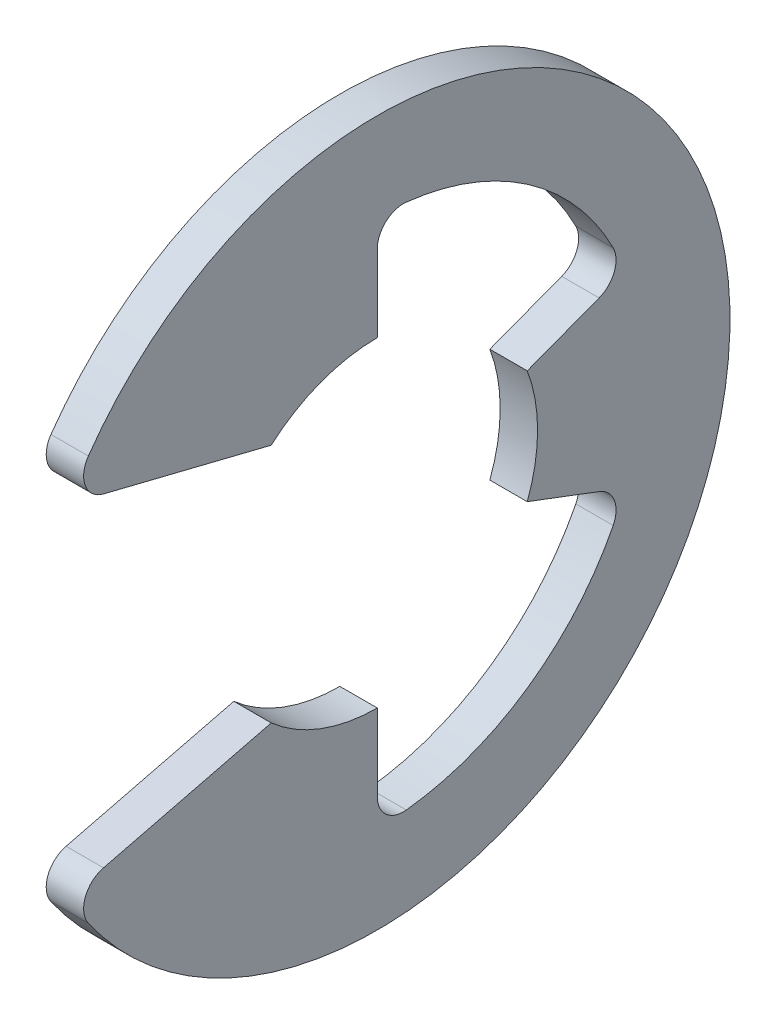
ISO-10303-21;
HEADER;
FILE_DESCRIPTION(('STEP AP214'),'2;1');
FILE_NAME('part.step','',(''),(''),'','','');
FILE_SCHEMA(('AUTOMOTIVE_DESIGN { 1 0 10303 214 1 1 1 1 }'));
ENDSEC;
DATA;
#1=APPLICATION_CONTEXT('core data for automotive mechanical design processes');
#2=APPLICATION_PROTOCOL_DEFINITION('international standard','automotive_design',2000,#1);
#3=PRODUCT_CONTEXT('',#1,'mechanical');
#4=PRODUCT('Part','Part','',(#3));
#5=PRODUCT_RELATED_PRODUCT_CATEGORY('part','',(#4));
#6=PRODUCT_DEFINITION_FORMATION('','',#4);
#7=PRODUCT_DEFINITION_CONTEXT('part definition',#1,'design');
#8=PRODUCT_DEFINITION('design','',#6,#7);
#9=PRODUCT_DEFINITION_SHAPE('','',#8);
#10=(LENGTH_UNIT() NAMED_UNIT(*) SI_UNIT(.MILLI.,.METRE.));
#11=(NAMED_UNIT(*) PLANE_ANGLE_UNIT() SI_UNIT($,.RADIAN.));
#12=(NAMED_UNIT(*) SI_UNIT($,.STERADIAN.) SOLID_ANGLE_UNIT());
#13=UNCERTAINTY_MEASURE_WITH_UNIT(LENGTH_MEASURE(1.E-05),#10,'distance_accuracy_value','');
#14=(GEOMETRIC_REPRESENTATION_CONTEXT(3) GLOBAL_UNCERTAINTY_ASSIGNED_CONTEXT((#13)) GLOBAL_UNIT_ASSIGNED_CONTEXT((#10,
#11,#12)) REPRESENTATION_CONTEXT('',''));
#15=CARTESIAN_POINT('',(0.,0.,0.));
#16=DIRECTION('',(0.,0.,1.));
#17=DIRECTION('',(1.,0.,0.));
#18=AXIS2_PLACEMENT_3D('',#15,#16,#17);
#19=CARTESIAN_POINT('',(0.4445,0.,0.));
#20=DIRECTION('',(-1.,0.,0.));
#21=DIRECTION('',(0.,0.,1.));
#22=AXIS2_PLACEMENT_3D('',#19,#20,#21);
#23=CYLINDRICAL_SURFACE('',#22,8.382);
#24=CARTESIAN_POINT('',(0.4445,0.,0.));
#25=DIRECTION('',(1.,0.,0.));
#26=DIRECTION('',(0.,0.,-1.));
#27=AXIS2_PLACEMENT_3D('',#24,#25,#26);
#28=CIRCLE('',#27,8.382);
#29=CARTESIAN_POINT('',(0.4445,-4.80802904314384,6.86591441253715));
#30=VERTEX_POINT('',#29);
#31=CARTESIAN_POINT('',(0.4445,4.80802904314383,6.86591441253715));
#32=VERTEX_POINT('',#31);
#33=EDGE_CURVE('E170',#30,#32,#28,.T.);
#34=ORIENTED_EDGE('',*,*,#33,.F.);
#35=DIRECTION('',(-1.,0.,0.));
#36=VECTOR('',#35,1.);
#37=CARTESIAN_POINT('',(0.4445,-4.80802904314384,6.86591441253715));
#38=LINE('',#37,#36);
#39=CARTESIAN_POINT('',(-0.4445,-4.80802904314384,6.86591441253715));
#40=VERTEX_POINT('',#39);
#41=EDGE_CURVE('E264',#30,#40,#38,.T.);
#42=ORIENTED_EDGE('',*,*,#41,.T.);
#43=CARTESIAN_POINT('',(-0.4445,0.,0.));
#44=DIRECTION('',(1.,0.,0.));
#45=DIRECTION('',(0.,0.,-1.));
#46=AXIS2_PLACEMENT_3D('',#43,#44,#45);
#47=CIRCLE('',#46,8.382);
#48=CARTESIAN_POINT('',(-0.4445,4.80802904314383,6.86591441253715));
#49=VERTEX_POINT('',#48);
#50=EDGE_CURVE('E208',#40,#49,#47,.T.);
#51=ORIENTED_EDGE('',*,*,#50,.T.);
#52=DIRECTION('',(-1.,0.,0.));
#53=VECTOR('',#52,1.);
#54=CARTESIAN_POINT('',(0.4445,4.80802904314383,6.86591441253715));
#55=LINE('',#54,#53);
#56=EDGE_CURVE('E262',#49,#32,#55,.F.);
#57=ORIENTED_EDGE('',*,*,#56,.T.);
#58=EDGE_LOOP('',(#34,#42,#51,#57));
#59=FACE_BOUND('',#58,.T.);
#60=ADVANCED_FACE('F32',(#59),#23,.T.);
#61=CARTESIAN_POINT('',(0.4445,4.05333224143882,7.33678551823021));
#62=DIRECTION('',(0.,0.970536829925373,-0.240952820606873));
#63=DIRECTION('',(0.,0.240952820606873,0.970536829925373));
#64=AXIS2_PLACEMENT_3D('',#61,#62,#63);
#65=PLANE('',#64);
#66=DIRECTION('',(0.,-0.240952820606873,-0.970536829925373));
#67=VECTOR('',#66,1.);
#68=CARTESIAN_POINT('',(0.4445,4.05333224143882,7.33678551823021));
#69=LINE('',#68,#67);
#70=CARTESIAN_POINT('',(0.4445,3.84710424189029,6.50611722217305));
#71=VERTEX_POINT('',#70);
#72=CARTESIAN_POINT('',(0.4445,2.8575,2.52007812378902));
#73=VERTEX_POINT('',#72);
#74=EDGE_CURVE('E156',#71,#73,#69,.T.);
#75=ORIENTED_EDGE('',*,*,#74,.F.);
#76=DIRECTION('',(-1.,0.,0.));
#77=VECTOR('',#76,1.);
#78=CARTESIAN_POINT('',(0.4445,3.84710424189029,6.50611722217305));
#79=LINE('',#78,#77);
#80=CARTESIAN_POINT('',(-0.4445,3.84710424189029,6.50611722217305));
#81=VERTEX_POINT('',#80);
#82=EDGE_CURVE('E276',#71,#81,#79,.T.);
#83=ORIENTED_EDGE('',*,*,#82,.T.);
#84=DIRECTION('',(0.,-0.240952820606873,-0.970536829925373));
#85=VECTOR('',#84,1.);
#86=CARTESIAN_POINT('',(-0.4445,4.05333224143882,7.33678551823021));
#87=LINE('',#86,#85);
#88=CARTESIAN_POINT('',(-0.4445,2.8575,2.52007812378902));
#89=VERTEX_POINT('',#88);
#90=EDGE_CURVE('E176',#81,#89,#87,.T.);
#91=ORIENTED_EDGE('',*,*,#90,.T.);
#92=DIRECTION('',(-1.,0.,0.));
#93=VECTOR('',#92,1.);
#94=CARTESIAN_POINT('',(0.4445,2.8575,2.52007812378902));
#95=LINE('',#94,#93);
#96=EDGE_CURVE('E173',#73,#89,#95,.T.);
#97=ORIENTED_EDGE('',*,*,#96,.F.);
#98=EDGE_LOOP('',(#75,#83,#91,#97));
#99=FACE_BOUND('',#98,.T.);
#100=ADVANCED_FACE('F174',(#99),#65,.F.);
#101=CARTESIAN_POINT('',(0.4445,0.,0.));
#102=DIRECTION('',(-1.,0.,0.));
#103=DIRECTION('',(0.,0.,1.));
#104=AXIS2_PLACEMENT_3D('',#101,#102,#103);
#105=CYLINDRICAL_SURFACE('',#104,3.81);
#106=CARTESIAN_POINT('',(-0.4445,0.,0.));
#107=DIRECTION('',(-1.,0.,0.));
#108=DIRECTION('',(0.,0.,1.));
#109=AXIS2_PLACEMENT_3D('',#106,#107,#108);
#110=CIRCLE('',#109,3.81);
#111=CARTESIAN_POINT('',(-0.4445,3.81,0.));
#112=VERTEX_POINT('',#111);
#113=EDGE_CURVE('E212',#89,#112,#110,.T.);
#114=ORIENTED_EDGE('',*,*,#113,.T.);
#115=DIRECTION('',(-1.,0.,0.));
#116=VECTOR('',#115,1.);
#117=CARTESIAN_POINT('',(0.4445,3.81,0.));
#118=LINE('',#117,#116);
#119=CARTESIAN_POINT('',(0.4445,3.81,0.));
#120=VERTEX_POINT('',#119);
#121=EDGE_CURVE('E180',#120,#112,#118,.T.);
#122=ORIENTED_EDGE('',*,*,#121,.F.);
#123=CARTESIAN_POINT('',(0.4445,0.,0.));
#124=DIRECTION('',(-1.,0.,0.));
#125=DIRECTION('',(0.,0.,1.));
#126=AXIS2_PLACEMENT_3D('',#123,#124,#125);
#127=CIRCLE('',#126,3.81);
#128=EDGE_CURVE('E162',#73,#120,#127,.T.);
#129=ORIENTED_EDGE('',*,*,#128,.F.);
#130=ORIENTED_EDGE('',*,*,#96,.T.);
#131=EDGE_LOOP('',(#114,#122,#129,#130));
#132=FACE_BOUND('',#131,.T.);
#133=ADVANCED_FACE('F182',(#132),#105,.F.);
#134=CARTESIAN_POINT('',(0.4445,3.81,0.));
#135=DIRECTION('',(0.,0.,1.));
#136=DIRECTION('',(0.,-1.,0.));
#137=AXIS2_PLACEMENT_3D('',#134,#135,#136);
#138=PLANE('',#137);
#139=DIRECTION('',(0.,1.,0.));
#140=VECTOR('',#139,1.);
#141=CARTESIAN_POINT('',(-0.4445,3.81,0.));
#142=LINE('',#141,#140);
#143=CARTESIAN_POINT('',(-0.4445,5.63609412254343,0.));
#144=VERTEX_POINT('',#143);
#145=EDGE_CURVE('E214',#112,#144,#142,.T.);
#146=ORIENTED_EDGE('',*,*,#145,.T.);
#147=DIRECTION('',(1.,0.,0.));
#148=VECTOR('',#147,1.);
#149=CARTESIAN_POINT('',(0.4445,5.63609412254343,0.));
#150=LINE('',#149,#148);
#151=CARTESIAN_POINT('',(0.4445,5.63609412254343,0.));
#152=VERTEX_POINT('',#151);
#153=EDGE_CURVE('E260',#144,#152,#150,.T.);
#154=ORIENTED_EDGE('',*,*,#153,.T.);
#155=DIRECTION('',(0.,1.,0.));
#156=VECTOR('',#155,1.);
#157=CARTESIAN_POINT('',(0.4445,3.81,0.));
#158=LINE('',#157,#156);
#159=EDGE_CURVE('E185',#120,#152,#158,.T.);
#160=ORIENTED_EDGE('',*,*,#159,.F.);
#161=ORIENTED_EDGE('',*,*,#121,.T.);
#162=EDGE_LOOP('',(#146,#154,#160,#161));
#163=FACE_BOUND('',#162,.T.);
#164=ADVANCED_FACE('F382',(#163),#138,.F.);
#165=CARTESIAN_POINT('',(0.4445,0.,0.));
#166=DIRECTION('',(-1.,0.,0.));
#167=DIRECTION('',(0.,0.,1.));
#168=AXIS2_PLACEMENT_3D('',#165,#166,#167);
#169=CYLINDRICAL_SURFACE('',#168,6.29264516129032);
#170=CARTESIAN_POINT('',(0.4445,0.,0.));
#171=DIRECTION('',(-1.,0.,0.));
#172=DIRECTION('',(0.,0.,-1.));
#173=AXIS2_PLACEMENT_3D('',#170,#171,#172);
#174=CIRCLE('',#173,6.29264516129032);
#175=CARTESIAN_POINT('',(0.4445,6.25463519415267,-0.690595188208944));
#176=VERTEX_POINT('',#175);
#177=CARTESIAN_POINT('',(0.4445,2.85734012662483,-5.60651322362572));
#178=VERTEX_POINT('',#177);
#179=EDGE_CURVE('E187',#176,#178,#174,.T.);
#180=ORIENTED_EDGE('',*,*,#179,.F.);
#181=DIRECTION('',(-1.,0.,0.));
#182=VECTOR('',#181,1.);
#183=CARTESIAN_POINT('',(0.4445,6.25463519415267,-0.690595188208944));
#184=LINE('',#183,#182);
#185=CARTESIAN_POINT('',(-0.4445,6.25463519415267,-0.690595188208944));
#186=VERTEX_POINT('',#185);
#187=EDGE_CURVE('E257',#176,#186,#184,.T.);
#188=ORIENTED_EDGE('',*,*,#187,.T.);
#189=CARTESIAN_POINT('',(-0.4445,0.,0.));
#190=DIRECTION('',(-1.,0.,0.));
#191=DIRECTION('',(0.,0.,-1.));
#192=AXIS2_PLACEMENT_3D('',#189,#190,#191);
#193=CIRCLE('',#192,6.29264516129032);
#194=CARTESIAN_POINT('',(-0.4445,2.85734012662483,-5.60651322362572));
#195=VERTEX_POINT('',#194);
#196=EDGE_CURVE('E217',#186,#195,#193,.T.);
#197=ORIENTED_EDGE('',*,*,#196,.T.);
#198=DIRECTION('',(-1.,0.,0.));
#199=VECTOR('',#198,1.);
#200=CARTESIAN_POINT('',(0.4445,2.85734012662483,-5.60651322362572));
#201=LINE('',#200,#199);
#202=EDGE_CURVE('E255',#195,#178,#201,.F.);
#203=ORIENTED_EDGE('',*,*,#202,.T.);
#204=EDGE_LOOP('',(#180,#188,#197,#203));
#205=FACE_BOUND('',#204,.T.);
#206=ADVANCED_FACE('F304',(#205),#169,.F.);
#207=CARTESIAN_POINT('',(0.4445,1.34703841816037,-3.56392866090218));
#208=DIRECTION('',(0.,-0.935414346693485,-0.353553390593274));
#209=DIRECTION('',(0.,0.353553390593274,-0.935414346693485));
#210=AXIS2_PLACEMENT_3D('',#207,#208,#209);
#211=PLANE('',#210);
#212=DIRECTION('',(0.,-0.353553390593274,0.935414346693485));
#213=VECTOR('',#212,1.);
#214=CARTESIAN_POINT('',(0.4445,1.34703841816037,-3.56392866090218));
#215=LINE('',#214,#213);
#216=CARTESIAN_POINT('',(0.4445,1.99266018672805,-5.27208330154195));
#217=VERTEX_POINT('',#216);
#218=CARTESIAN_POINT('',(0.4445,1.34703841816037,-3.56392866090218));
#219=VERTEX_POINT('',#218);
#220=EDGE_CURVE('E192',#217,#219,#215,.T.);
#221=ORIENTED_EDGE('',*,*,#220,.F.);
#222=DIRECTION('',(1.,0.,0.));
#223=VECTOR('',#222,1.);
#224=CARTESIAN_POINT('',(-0.4445,1.99266018672805,-5.27208330154195));
#225=LINE('',#224,#223);
#226=CARTESIAN_POINT('',(-0.4445,1.99266018672805,-5.27208330154195));
#227=VERTEX_POINT('',#226);
#228=EDGE_CURVE('E279',#217,#227,#225,.F.);
#229=ORIENTED_EDGE('',*,*,#228,.T.);
#230=DIRECTION('',(0.,-0.353553390593274,0.935414346693485));
#231=VECTOR('',#230,1.);
#232=CARTESIAN_POINT('',(-0.4445,1.34703841816037,-3.56392866090218));
#233=LINE('',#232,#231);
#234=CARTESIAN_POINT('',(-0.4445,1.34703841816037,-3.56392866090218));
#235=VERTEX_POINT('',#234);
#236=EDGE_CURVE('E220',#227,#235,#233,.T.);
#237=ORIENTED_EDGE('',*,*,#236,.T.);
#238=DIRECTION('',(-1.,0.,0.));
#239=VECTOR('',#238,1.);
#240=CARTESIAN_POINT('',(0.4445,1.34703841816037,-3.56392866090218));
#241=LINE('',#240,#239);
#242=EDGE_CURVE('E244',#219,#235,#241,.T.);
#243=ORIENTED_EDGE('',*,*,#242,.F.);
#244=EDGE_LOOP('',(#221,#229,#237,#243));
#245=FACE_BOUND('',#244,.T.);
#246=ADVANCED_FACE('F307',(#245),#211,.F.);
#247=CARTESIAN_POINT('',(0.4445,0.,0.));
#248=DIRECTION('',(-1.,0.,0.));
#249=DIRECTION('',(0.,0.,1.));
#250=AXIS2_PLACEMENT_3D('',#247,#248,#249);
#251=CYLINDRICAL_SURFACE('',#250,3.81);
#252=CARTESIAN_POINT('',(-0.4445,0.,0.));
#253=DIRECTION('',(-1.,0.,0.));
#254=DIRECTION('',(0.,0.,1.));
#255=AXIS2_PLACEMENT_3D('',#252,#253,#254);
#256=CIRCLE('',#255,3.81);
#257=CARTESIAN_POINT('',(-0.4445,-1.34703841816037,-3.56392866090218));
#258=VERTEX_POINT('',#257);
#259=EDGE_CURVE('E222',#235,#258,#256,.T.);
#260=ORIENTED_EDGE('',*,*,#259,.T.);
#261=DIRECTION('',(-1.,0.,0.));
#262=VECTOR('',#261,1.);
#263=CARTESIAN_POINT('',(0.4445,-1.34703841816037,-3.56392866090218));
#264=LINE('',#263,#262);
#265=CARTESIAN_POINT('',(0.4445,-1.34703841816037,-3.56392866090218));
#266=VERTEX_POINT('',#265);
#267=EDGE_CURVE('E241',#266,#258,#264,.T.);
#268=ORIENTED_EDGE('',*,*,#267,.F.);
#269=CARTESIAN_POINT('',(0.4445,0.,0.));
#270=DIRECTION('',(-1.,0.,0.));
#271=DIRECTION('',(0.,0.,1.));
#272=AXIS2_PLACEMENT_3D('',#269,#270,#271);
#273=CIRCLE('',#272,3.81);
#274=EDGE_CURVE('E194',#219,#266,#273,.T.);
#275=ORIENTED_EDGE('',*,*,#274,.F.);
#276=ORIENTED_EDGE('',*,*,#242,.T.);
#277=EDGE_LOOP('',(#260,#268,#275,#276));
#278=FACE_BOUND('',#277,.T.);
#279=ADVANCED_FACE('F313',(#278),#251,.F.);
#280=CARTESIAN_POINT('',(0.4445,-1.34703841816037,-3.56392866090218));
#281=DIRECTION('',(0.,0.935414346693485,-0.353553390593274));
#282=DIRECTION('',(0.,0.353553390593274,0.935414346693485));
#283=AXIS2_PLACEMENT_3D('',#280,#281,#282);
#284=PLANE('',#283);
#285=DIRECTION('',(0.,-0.353553390593274,-0.935414346693485));
#286=VECTOR('',#285,1.);
#287=CARTESIAN_POINT('',(-0.4445,-1.34703841816037,-3.56392866090218));
#288=LINE('',#287,#286);
#289=CARTESIAN_POINT('',(-0.4445,-1.99266018672805,-5.27208330154195));
#290=VERTEX_POINT('',#289);
#291=EDGE_CURVE('E224',#258,#290,#288,.T.);
#292=ORIENTED_EDGE('',*,*,#291,.T.);
#293=DIRECTION('',(1.,0.,0.));
#294=VECTOR('',#293,1.);
#295=CARTESIAN_POINT('',(0.4445,-1.99266018672805,-5.27208330154195));
#296=LINE('',#295,#294);
#297=CARTESIAN_POINT('',(0.4445,-1.99266018672805,-5.27208330154195));
#298=VERTEX_POINT('',#297);
#299=EDGE_CURVE('E47',#290,#298,#296,.T.);
#300=ORIENTED_EDGE('',*,*,#299,.T.);
#301=DIRECTION('',(0.,-0.353553390593274,-0.935414346693485));
#302=VECTOR('',#301,1.);
#303=CARTESIAN_POINT('',(0.4445,-1.34703841816037,-3.56392866090218));
#304=LINE('',#303,#302);
#305=EDGE_CURVE('E196',#266,#298,#304,.T.);
#306=ORIENTED_EDGE('',*,*,#305,.F.);
#307=ORIENTED_EDGE('',*,*,#267,.T.);
#308=EDGE_LOOP('',(#292,#300,#306,#307));
#309=FACE_BOUND('',#308,.T.);
#310=ADVANCED_FACE('F315',(#309),#284,.F.);
#311=CARTESIAN_POINT('',(0.4445,0.,0.));
#312=DIRECTION('',(-1.,0.,0.));
#313=DIRECTION('',(0.,0.,1.));
#314=AXIS2_PLACEMENT_3D('',#311,#312,#313);
#315=CYLINDRICAL_SURFACE('',#314,6.29264516129032);
#316=CARTESIAN_POINT('',(-0.4445,0.,0.));
#317=DIRECTION('',(-1.,0.,0.));
#318=DIRECTION('',(0.,0.,-1.));
#319=AXIS2_PLACEMENT_3D('',#316,#317,#318);
#320=CIRCLE('',#319,6.29264516129032);
#321=CARTESIAN_POINT('',(-0.4445,-2.85734012662483,-5.60651322362573));
#322=VERTEX_POINT('',#321);
#323=CARTESIAN_POINT('',(-0.4445,-6.25463519415267,-0.690595188208945));
#324=VERTEX_POINT('',#323);
#325=EDGE_CURVE('E226',#322,#324,#320,.T.);
#326=ORIENTED_EDGE('',*,*,#325,.T.);
#327=DIRECTION('',(-1.,0.,0.));
#328=VECTOR('',#327,1.);
#329=CARTESIAN_POINT('',(0.4445,-6.25463519415267,-0.690595188208945));
#330=LINE('',#329,#328);
#331=CARTESIAN_POINT('',(0.4445,-6.25463519415267,-0.690595188208945));
#332=VERTEX_POINT('',#331);
#333=EDGE_CURVE('E253',#324,#332,#330,.F.);
#334=ORIENTED_EDGE('',*,*,#333,.T.);
#335=CARTESIAN_POINT('',(0.4445,0.,0.));
#336=DIRECTION('',(-1.,0.,0.));
#337=DIRECTION('',(0.,0.,-1.));
#338=AXIS2_PLACEMENT_3D('',#335,#336,#337);
#339=CIRCLE('',#338,6.29264516129032);
#340=CARTESIAN_POINT('',(0.4445,-2.85734012662483,-5.60651322362573));
#341=VERTEX_POINT('',#340);
#342=EDGE_CURVE('E198',#341,#332,#339,.T.);
#343=ORIENTED_EDGE('',*,*,#342,.F.);
#344=DIRECTION('',(-1.,0.,0.));
#345=VECTOR('',#344,1.);
#346=CARTESIAN_POINT('',(0.4445,-2.85734012662483,-5.60651322362573));
#347=LINE('',#346,#345);
#348=EDGE_CURVE('E250',#341,#322,#347,.T.);
#349=ORIENTED_EDGE('',*,*,#348,.T.);
#350=EDGE_LOOP('',(#326,#334,#343,#349));
#351=FACE_BOUND('',#350,.T.);
#352=ADVANCED_FACE('F317',(#351),#315,.F.);
#353=CARTESIAN_POINT('',(0.4445,-3.81,0.));
#354=DIRECTION('',(0.,0.,1.));
#355=DIRECTION('',(0.,-1.,0.));
#356=AXIS2_PLACEMENT_3D('',#353,#354,#355);
#357=PLANE('',#356);
#358=DIRECTION('',(0.,1.,0.));
#359=VECTOR('',#358,1.);
#360=CARTESIAN_POINT('',(0.4445,-3.81,0.));
#361=LINE('',#360,#359);
#362=CARTESIAN_POINT('',(0.4445,-5.63609412254343,0.));
#363=VERTEX_POINT('',#362);
#364=CARTESIAN_POINT('',(0.4445,-3.81,0.));
#365=VERTEX_POINT('',#364);
#366=EDGE_CURVE('E201',#363,#365,#361,.T.);
#367=ORIENTED_EDGE('',*,*,#366,.F.);
#368=DIRECTION('',(1.,0.,0.));
#369=VECTOR('',#368,1.);
#370=CARTESIAN_POINT('',(-0.4445,-5.63609412254343,0.));
#371=LINE('',#370,#369);
#372=CARTESIAN_POINT('',(-0.4445,-5.63609412254343,0.));
#373=VERTEX_POINT('',#372);
#374=EDGE_CURVE('E179',#363,#373,#371,.F.);
#375=ORIENTED_EDGE('',*,*,#374,.T.);
#376=DIRECTION('',(0.,1.,0.));
#377=VECTOR('',#376,1.);
#378=CARTESIAN_POINT('',(-0.4445,-3.81,0.));
#379=LINE('',#378,#377);
#380=CARTESIAN_POINT('',(-0.4445,-3.81,0.));
#381=VERTEX_POINT('',#380);
#382=EDGE_CURVE('E229',#373,#381,#379,.T.);
#383=ORIENTED_EDGE('',*,*,#382,.T.);
#384=DIRECTION('',(-1.,0.,0.));
#385=VECTOR('',#384,1.);
#386=CARTESIAN_POINT('',(0.4445,-3.81,0.));
#387=LINE('',#386,#385);
#388=EDGE_CURVE('E238',#365,#381,#387,.T.);
#389=ORIENTED_EDGE('',*,*,#388,.F.);
#390=EDGE_LOOP('',(#367,#375,#383,#389));
#391=FACE_BOUND('',#390,.T.);
#392=ADVANCED_FACE('F323',(#391),#357,.F.);
#393=CARTESIAN_POINT('',(0.4445,0.,0.));
#394=DIRECTION('',(-1.,0.,0.));
#395=DIRECTION('',(0.,0.,1.));
#396=AXIS2_PLACEMENT_3D('',#393,#394,#395);
#397=CYLINDRICAL_SURFACE('',#396,3.81);
#398=CARTESIAN_POINT('',(-0.4445,0.,0.));
#399=DIRECTION('',(-1.,0.,0.));
#400=DIRECTION('',(0.,0.,-1.));
#401=AXIS2_PLACEMENT_3D('',#398,#399,#400);
#402=CIRCLE('',#401,3.81);
#403=CARTESIAN_POINT('',(-0.4445,-2.8575,2.52007812378902));
#404=VERTEX_POINT('',#403);
#405=EDGE_CURVE('E231',#381,#404,#402,.T.);
#406=ORIENTED_EDGE('',*,*,#405,.T.);
#407=DIRECTION('',(-1.,0.,0.));
#408=VECTOR('',#407,1.);
#409=CARTESIAN_POINT('',(0.4445,-2.8575,2.52007812378902));
#410=LINE('',#409,#408);
#411=CARTESIAN_POINT('',(0.4445,-2.8575,2.52007812378902));
#412=VERTEX_POINT('',#411);
#413=EDGE_CURVE('E207',#412,#404,#410,.T.);
#414=ORIENTED_EDGE('',*,*,#413,.F.);
#415=CARTESIAN_POINT('',(0.4445,0.,0.));
#416=DIRECTION('',(-1.,0.,0.));
#417=DIRECTION('',(0.,0.,-1.));
#418=AXIS2_PLACEMENT_3D('',#415,#416,#417);
#419=CIRCLE('',#418,3.81);
#420=EDGE_CURVE('E203',#365,#412,#419,.T.);
#421=ORIENTED_EDGE('',*,*,#420,.F.);
#422=ORIENTED_EDGE('',*,*,#388,.T.);
#423=EDGE_LOOP('',(#406,#414,#421,#422));
#424=FACE_BOUND('',#423,.T.);
#425=ADVANCED_FACE('F372',(#424),#397,.F.);
#426=CARTESIAN_POINT('',(0.4445,-4.05333224143882,7.33678551823021));
#427=DIRECTION('',(0.,-0.970536829925373,-0.240952820606873));
#428=DIRECTION('',(0.,0.240952820606873,-0.970536829925373));
#429=AXIS2_PLACEMENT_3D('',#426,#427,#428);
#430=PLANE('',#429);
#431=DIRECTION('',(0.,-0.240952820606873,0.970536829925373));
#432=VECTOR('',#431,1.);
#433=CARTESIAN_POINT('',(-0.4445,-4.05333224143882,7.33678551823021));
#434=LINE('',#433,#432);
#435=CARTESIAN_POINT('',(-0.4445,-3.8471042418903,6.50611722217305));
#436=VERTEX_POINT('',#435);
#437=EDGE_CURVE('E233',#404,#436,#434,.T.);
#438=ORIENTED_EDGE('',*,*,#437,.T.);
#439=DIRECTION('',(-1.,0.,0.));
#440=VECTOR('',#439,1.);
#441=CARTESIAN_POINT('',(0.4445,-3.8471042418903,6.50611722217305));
#442=LINE('',#441,#440);
#443=CARTESIAN_POINT('',(0.4445,-3.8471042418903,6.50611722217305));
#444=VERTEX_POINT('',#443);
#445=EDGE_CURVE('E271',#436,#444,#442,.F.);
#446=ORIENTED_EDGE('',*,*,#445,.T.);
#447=DIRECTION('',(0.,-0.240952820606873,0.970536829925373));
#448=VECTOR('',#447,1.);
#449=CARTESIAN_POINT('',(0.4445,-4.05333224143882,7.33678551823021));
#450=LINE('',#449,#448);
#451=EDGE_CURVE('E205',#412,#444,#450,.T.);
#452=ORIENTED_EDGE('',*,*,#451,.F.);
#453=ORIENTED_EDGE('',*,*,#413,.T.);
#454=EDGE_LOOP('',(#438,#446,#452,#453));
#455=FACE_BOUND('',#454,.T.);
#456=ADVANCED_FACE('F414',(#455),#430,.F.);
#457=CARTESIAN_POINT('',(0.4445,0.,0.));
#458=DIRECTION('',(1.,0.,0.));
#459=DIRECTION('',(0.,0.,-1.));
#460=AXIS2_PLACEMENT_3D('',#457,#458,#459);
#461=PLANE('',#460);
#462=ORIENTED_EDGE('',*,*,#451,.T.);
#463=CARTESIAN_POINT('',(0.4445,-4.45106931115285,6.35617228190939));
#464=DIRECTION('',(1.,0.,0.));
#465=DIRECTION('',(0.,0.,-1.));
#466=AXIS2_PLACEMENT_3D('',#463,#464,#465);
#467=CIRCLE('',#466,0.6223);
#468=EDGE_CURVE('E274',#444,#30,#467,.T.);
#469=ORIENTED_EDGE('',*,*,#468,.T.);
#470=ORIENTED_EDGE('',*,*,#33,.T.);
#471=CARTESIAN_POINT('',(0.4445,4.45106931115285,6.35617228190939));
#472=DIRECTION('',(1.,0.,0.));
#473=DIRECTION('',(0.,0.,-1.));
#474=AXIS2_PLACEMENT_3D('',#471,#472,#473);
#475=CIRCLE('',#474,0.6223);
#476=EDGE_CURVE('E166',#32,#71,#475,.T.);
#477=ORIENTED_EDGE('',*,*,#476,.T.);
#478=ORIENTED_EDGE('',*,*,#74,.T.);
#479=ORIENTED_EDGE('',*,*,#128,.T.);
#480=ORIENTED_EDGE('',*,*,#159,.T.);
#481=CARTESIAN_POINT('',(0.4445,5.63609412254343,-0.622299999999999));
#482=DIRECTION('',(1.,0.,0.));
#483=DIRECTION('',(0.,0.,-1.));
#484=AXIS2_PLACEMENT_3D('',#481,#482,#483);
#485=CIRCLE('',#484,0.6223);
#486=EDGE_CURVE('E288',#152,#176,#485,.F.);
#487=ORIENTED_EDGE('',*,*,#486,.T.);
#488=ORIENTED_EDGE('',*,*,#179,.T.);
#489=CARTESIAN_POINT('',(0.4445,2.57476853467541,-5.05206702657576));
#490=DIRECTION('',(1.,0.,0.));
#491=DIRECTION('',(0.,0.,-1.));
#492=AXIS2_PLACEMENT_3D('',#489,#490,#491);
#493=CIRCLE('',#492,0.6223);
#494=EDGE_CURVE('E11',#178,#217,#493,.F.);
#495=ORIENTED_EDGE('',*,*,#494,.T.);
#496=ORIENTED_EDGE('',*,*,#220,.T.);
#497=ORIENTED_EDGE('',*,*,#274,.T.);
#498=ORIENTED_EDGE('',*,*,#305,.T.);
#499=CARTESIAN_POINT('',(0.4445,-2.57476853467541,-5.05206702657576));
#500=DIRECTION('',(1.,0.,0.));
#501=DIRECTION('',(0.,0.,-1.));
#502=AXIS2_PLACEMENT_3D('',#499,#500,#501);
#503=CIRCLE('',#502,0.6223);
#504=EDGE_CURVE('E292',#298,#341,#503,.F.);
#505=ORIENTED_EDGE('',*,*,#504,.T.);
#506=ORIENTED_EDGE('',*,*,#342,.T.);
#507=CARTESIAN_POINT('',(0.4445,-5.63609412254343,-0.622300000000001));
#508=DIRECTION('',(1.,0.,0.));
#509=DIRECTION('',(0.,0.,-1.));
#510=AXIS2_PLACEMENT_3D('',#507,#508,#509);
#511=CIRCLE('',#510,0.6223);
#512=EDGE_CURVE('E284',#332,#363,#511,.F.);
#513=ORIENTED_EDGE('',*,*,#512,.T.);
#514=ORIENTED_EDGE('',*,*,#366,.T.);
#515=ORIENTED_EDGE('',*,*,#420,.T.);
#516=EDGE_LOOP('',(#462,#469,#470,#477,#478,#479,#480,#487,#488,#495,#496,#497,#498,#505,#506,
#513,#514,#515));
#517=FACE_BOUND('',#516,.T.);
#518=ADVANCED_FACE('F159',(#517),#461,.T.);
#519=CARTESIAN_POINT('',(-0.4445,0.,0.));
#520=DIRECTION('',(1.,0.,0.));
#521=DIRECTION('',(0.,0.,-1.));
#522=AXIS2_PLACEMENT_3D('',#519,#520,#521);
#523=PLANE('',#522);
#524=ORIENTED_EDGE('',*,*,#50,.F.);
#525=CARTESIAN_POINT('',(-0.4445,-4.45106931115285,6.35617228190939));
#526=DIRECTION('',(1.,0.,0.));
#527=DIRECTION('',(0.,0.,-1.));
#528=AXIS2_PLACEMENT_3D('',#525,#526,#527);
#529=CIRCLE('',#528,0.6223);
#530=EDGE_CURVE('E269',#40,#436,#529,.F.);
#531=ORIENTED_EDGE('',*,*,#530,.T.);
#532=ORIENTED_EDGE('',*,*,#437,.F.);
#533=ORIENTED_EDGE('',*,*,#405,.F.);
#534=ORIENTED_EDGE('',*,*,#382,.F.);
#535=CARTESIAN_POINT('',(-0.4445,-5.63609412254343,-0.622300000000001));
#536=DIRECTION('',(1.,0.,0.));
#537=DIRECTION('',(0.,0.,-1.));
#538=AXIS2_PLACEMENT_3D('',#535,#536,#537);
#539=CIRCLE('',#538,0.6223);
#540=EDGE_CURVE('E282',#373,#324,#539,.T.);
#541=ORIENTED_EDGE('',*,*,#540,.T.);
#542=ORIENTED_EDGE('',*,*,#325,.F.);
#543=CARTESIAN_POINT('',(-0.4445,-2.57476853467541,-5.05206702657576));
#544=DIRECTION('',(1.,0.,0.));
#545=DIRECTION('',(0.,0.,-1.));
#546=AXIS2_PLACEMENT_3D('',#543,#544,#545);
#547=CIRCLE('',#546,0.6223);
#548=EDGE_CURVE('E290',#322,#290,#547,.T.);
#549=ORIENTED_EDGE('',*,*,#548,.T.);
#550=ORIENTED_EDGE('',*,*,#291,.F.);
#551=ORIENTED_EDGE('',*,*,#259,.F.);
#552=ORIENTED_EDGE('',*,*,#236,.F.);
#553=CARTESIAN_POINT('',(-0.4445,2.57476853467541,-5.05206702657576));
#554=DIRECTION('',(1.,0.,0.));
#555=DIRECTION('',(0.,0.,-1.));
#556=AXIS2_PLACEMENT_3D('',#553,#554,#555);
#557=CIRCLE('',#556,0.6223);
#558=EDGE_CURVE('E40',#227,#195,#557,.T.);
#559=ORIENTED_EDGE('',*,*,#558,.T.);
#560=ORIENTED_EDGE('',*,*,#196,.F.);
#561=CARTESIAN_POINT('',(-0.4445,5.63609412254343,-0.622299999999999));
#562=DIRECTION('',(1.,0.,0.));
#563=DIRECTION('',(0.,0.,-1.));
#564=AXIS2_PLACEMENT_3D('',#561,#562,#563);
#565=CIRCLE('',#564,0.6223);
#566=EDGE_CURVE('E286',#186,#144,#565,.T.);
#567=ORIENTED_EDGE('',*,*,#566,.T.);
#568=ORIENTED_EDGE('',*,*,#145,.F.);
#569=ORIENTED_EDGE('',*,*,#113,.F.);
#570=ORIENTED_EDGE('',*,*,#90,.F.);
#571=CARTESIAN_POINT('',(-0.4445,4.45106931115285,6.35617228190939));
#572=DIRECTION('',(1.,0.,0.));
#573=DIRECTION('',(0.,0.,-1.));
#574=AXIS2_PLACEMENT_3D('',#571,#572,#573);
#575=CIRCLE('',#574,0.6223);
#576=EDGE_CURVE('E267',#81,#49,#575,.F.);
#577=ORIENTED_EDGE('',*,*,#576,.T.);
#578=EDGE_LOOP('',(#524,#531,#532,#533,#534,#541,#542,#549,#550,#551,#552,#559,#560,#567,#568,
#569,#570,#577));
#579=FACE_BOUND('',#578,.T.);
#580=ADVANCED_FACE('F297',(#579),#523,.F.);
#581=CARTESIAN_POINT('',(0.4445,-5.63609412254343,-0.622300000000001));
#582=DIRECTION('',(-1.,0.,0.));
#583=DIRECTION('',(0.,0.,1.));
#584=AXIS2_PLACEMENT_3D('',#581,#582,#583);
#585=CYLINDRICAL_SURFACE('',#584,0.6223);
#586=ORIENTED_EDGE('',*,*,#512,.F.);
#587=ORIENTED_EDGE('',*,*,#333,.F.);
#588=ORIENTED_EDGE('',*,*,#540,.F.);
#589=ORIENTED_EDGE('',*,*,#374,.F.);
#590=EDGE_LOOP('',(#586,#587,#588,#589));
#591=FACE_BOUND('',#590,.T.);
#592=ADVANCED_FACE('F337',(#591),#585,.F.);
#593=CARTESIAN_POINT('',(0.4445,5.63609412254343,-0.622299999999999));
#594=DIRECTION('',(-1.,0.,0.));
#595=DIRECTION('',(0.,0.,1.));
#596=AXIS2_PLACEMENT_3D('',#593,#594,#595);
#597=CYLINDRICAL_SURFACE('',#596,0.6223);
#598=ORIENTED_EDGE('',*,*,#486,.F.);
#599=ORIENTED_EDGE('',*,*,#153,.F.);
#600=ORIENTED_EDGE('',*,*,#566,.F.);
#601=ORIENTED_EDGE('',*,*,#187,.F.);
#602=EDGE_LOOP('',(#598,#599,#600,#601));
#603=FACE_BOUND('',#602,.T.);
#604=ADVANCED_FACE('F340',(#603),#597,.F.);
#605=CARTESIAN_POINT('',(0.4445,-4.45106931115285,6.35617228190939));
#606=DIRECTION('',(-1.,0.,0.));
#607=DIRECTION('',(0.,0.,1.));
#608=AXIS2_PLACEMENT_3D('',#605,#606,#607);
#609=CYLINDRICAL_SURFACE('',#608,0.6223);
#610=ORIENTED_EDGE('',*,*,#468,.F.);
#611=ORIENTED_EDGE('',*,*,#445,.F.);
#612=ORIENTED_EDGE('',*,*,#530,.F.);
#613=ORIENTED_EDGE('',*,*,#41,.F.);
#614=EDGE_LOOP('',(#610,#611,#612,#613));
#615=FACE_BOUND('',#614,.T.);
#616=ADVANCED_FACE('F344',(#615),#609,.T.);
#617=CARTESIAN_POINT('',(0.4445,4.45106931115285,6.35617228190939));
#618=DIRECTION('',(-1.,0.,0.));
#619=DIRECTION('',(0.,0.,1.));
#620=AXIS2_PLACEMENT_3D('',#617,#618,#619);
#621=CYLINDRICAL_SURFACE('',#620,0.6223);
#622=ORIENTED_EDGE('',*,*,#476,.F.);
#623=ORIENTED_EDGE('',*,*,#56,.F.);
#624=ORIENTED_EDGE('',*,*,#576,.F.);
#625=ORIENTED_EDGE('',*,*,#82,.F.);
#626=EDGE_LOOP('',(#622,#623,#624,#625));
#627=FACE_BOUND('',#626,.T.);
#628=ADVANCED_FACE('F348',(#627),#621,.T.);
#629=CARTESIAN_POINT('',(0.4445,-2.57476853467541,-5.05206702657576));
#630=DIRECTION('',(-1.,0.,0.));
#631=DIRECTION('',(0.,0.,1.));
#632=AXIS2_PLACEMENT_3D('',#629,#630,#631);
#633=CYLINDRICAL_SURFACE('',#632,0.6223);
#634=ORIENTED_EDGE('',*,*,#504,.F.);
#635=ORIENTED_EDGE('',*,*,#299,.F.);
#636=ORIENTED_EDGE('',*,*,#548,.F.);
#637=ORIENTED_EDGE('',*,*,#348,.F.);
#638=EDGE_LOOP('',(#634,#635,#636,#637));
#639=FACE_BOUND('',#638,.T.);
#640=ADVANCED_FACE('F351',(#639),#633,.F.);
#641=CARTESIAN_POINT('',(0.4445,2.57476853467541,-5.05206702657576));
#642=DIRECTION('',(-1.,0.,0.));
#643=DIRECTION('',(0.,0.,1.));
#644=AXIS2_PLACEMENT_3D('',#641,#642,#643);
#645=CYLINDRICAL_SURFACE('',#644,0.6223);
#646=ORIENTED_EDGE('',*,*,#494,.F.);
#647=ORIENTED_EDGE('',*,*,#202,.F.);
#648=ORIENTED_EDGE('',*,*,#558,.F.);
#649=ORIENTED_EDGE('',*,*,#228,.F.);
#650=EDGE_LOOP('',(#646,#647,#648,#649));
#651=FACE_BOUND('',#650,.T.);
#652=ADVANCED_FACE('F34',(#651),#645,.F.);
#653=CLOSED_SHELL('',(#60,#100,#133,#164,#206,#246,#279,#310,#352,#392,#425,#456,#518,#580,#592,
#604,#616,#628,#640,#652));
#654=MANIFOLD_SOLID_BREP('B2',#653);
#655=ADVANCED_BREP_SHAPE_REPRESENTATION('',(#18,#654),#14);
#656=SHAPE_DEFINITION_REPRESENTATION(#9,#655);
ENDSEC;
END-ISO-10303-21;
